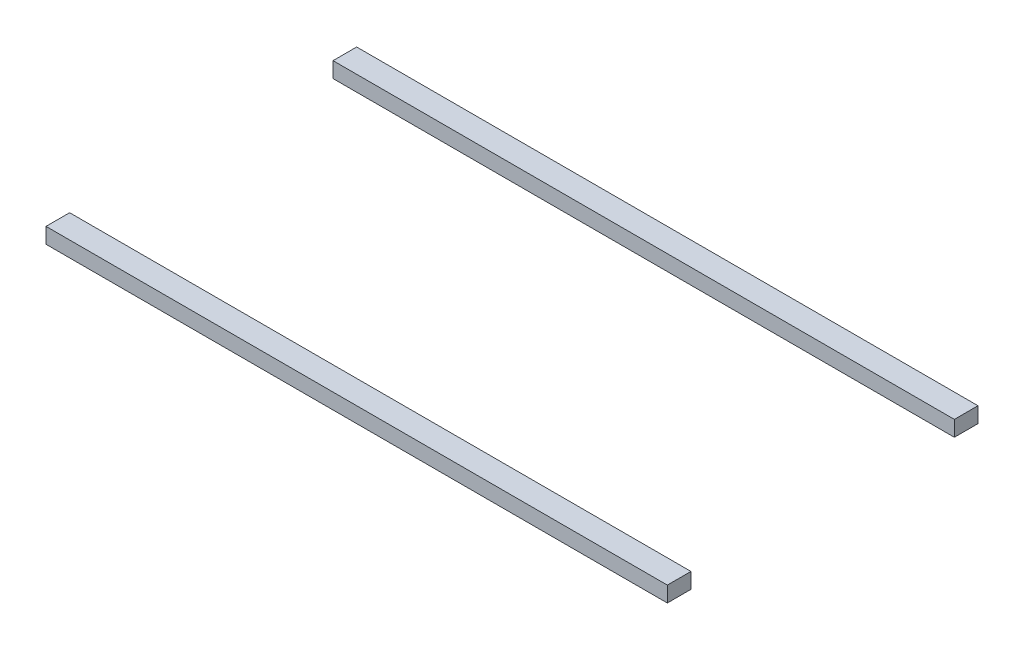
ISO-10303-21;
HEADER;
FILE_DESCRIPTION(('STEP AP214'),'2;1');
FILE_NAME('part.step','',(''),(''),'','','');
FILE_SCHEMA(('AUTOMOTIVE_DESIGN { 1 0 10303 214 1 1 1 1 }'));
ENDSEC;
DATA;
#1=APPLICATION_CONTEXT('core data for automotive mechanical design processes');
#2=APPLICATION_PROTOCOL_DEFINITION('international standard','automotive_design',2000,#1);
#3=PRODUCT_CONTEXT('',#1,'mechanical');
#4=PRODUCT('Part','Part','',(#3));
#5=PRODUCT_RELATED_PRODUCT_CATEGORY('part','',(#4));
#6=PRODUCT_DEFINITION_FORMATION('','',#4);
#7=PRODUCT_DEFINITION_CONTEXT('part definition',#1,'design');
#8=PRODUCT_DEFINITION('design','',#6,#7);
#9=PRODUCT_DEFINITION_SHAPE('','',#8);
#10=(LENGTH_UNIT() NAMED_UNIT(*) SI_UNIT(.MILLI.,.METRE.));
#11=(NAMED_UNIT(*) PLANE_ANGLE_UNIT() SI_UNIT($,.RADIAN.));
#12=(NAMED_UNIT(*) SI_UNIT($,.STERADIAN.) SOLID_ANGLE_UNIT());
#13=UNCERTAINTY_MEASURE_WITH_UNIT(LENGTH_MEASURE(1.E-05),#10,'distance_accuracy_value','');
#14=(GEOMETRIC_REPRESENTATION_CONTEXT(3) GLOBAL_UNCERTAINTY_ASSIGNED_CONTEXT((#13)) GLOBAL_UNIT_ASSIGNED_CONTEXT((#10,
#11,#12)) REPRESENTATION_CONTEXT('',''));
#15=CARTESIAN_POINT('',(0.,0.,0.));
#16=DIRECTION('',(0.,0.,1.));
#17=DIRECTION('',(1.,0.,0.));
#18=AXIS2_PLACEMENT_3D('',#15,#16,#17);
#19=CARTESIAN_POINT('',(0.,2.54,-21.5339538869623));
#20=DIRECTION('',(0.,0.,1.));
#21=DIRECTION('',(1.,0.,0.));
#22=AXIS2_PLACEMENT_3D('',#19,#20,#21);
#23=PLANE('',#22);
#24=DIRECTION('',(-1.,0.,0.));
#25=VECTOR('',#24,1.);
#26=CARTESIAN_POINT('',(0.,0.,-21.5339538869623));
#27=LINE('',#26,#25);
#28=CARTESIAN_POINT('',(50.8000000000001,0.,-21.5339538869623));
#29=VERTEX_POINT('',#28);
#30=CARTESIAN_POINT('',(-50.8000000000001,0.,-21.5339538869623));
#31=VERTEX_POINT('',#30);
#32=EDGE_CURVE('E108',#29,#31,#27,.T.);
#33=ORIENTED_EDGE('',*,*,#32,.F.);
#34=DIRECTION('',(0.,-1.,0.));
#35=VECTOR('',#34,1.);
#36=CARTESIAN_POINT('',(50.8000000000001,2.54,-21.5339538869623));
#37=LINE('',#36,#35);
#38=CARTESIAN_POINT('',(50.8000000000001,2.54,-21.5339538869623));
#39=VERTEX_POINT('',#38);
#40=EDGE_CURVE('E12',#39,#29,#37,.T.);
#41=ORIENTED_EDGE('',*,*,#40,.F.);
#42=DIRECTION('',(-1.,0.,0.));
#43=VECTOR('',#42,1.);
#44=CARTESIAN_POINT('',(0.,2.54,-21.5339538869623));
#45=LINE('',#44,#43);
#46=CARTESIAN_POINT('',(-50.8000000000001,2.54,-21.5339538869623));
#47=VERTEX_POINT('',#46);
#48=EDGE_CURVE('E101',#39,#47,#45,.T.);
#49=ORIENTED_EDGE('',*,*,#48,.T.);
#50=DIRECTION('',(0.,-1.,0.));
#51=VECTOR('',#50,1.);
#52=CARTESIAN_POINT('',(-50.8000000000001,2.54,-21.5339538869623));
#53=LINE('',#52,#51);
#54=EDGE_CURVE('E83',#47,#31,#53,.T.);
#55=ORIENTED_EDGE('',*,*,#54,.T.);
#56=EDGE_LOOP('',(#33,#41,#49,#55));
#57=FACE_BOUND('',#56,.T.);
#58=ADVANCED_FACE('F45',(#57),#23,.T.);
#59=CARTESIAN_POINT('',(50.8000000000001,2.54,0.));
#60=DIRECTION('',(1.,0.,0.));
#61=DIRECTION('',(0.,0.,-1.));
#62=AXIS2_PLACEMENT_3D('',#59,#60,#61);
#63=PLANE('',#62);
#64=DIRECTION('',(0.,0.,1.));
#65=VECTOR('',#64,1.);
#66=CARTESIAN_POINT('',(50.8000000000001,0.,0.));
#67=LINE('',#66,#65);
#68=CARTESIAN_POINT('',(50.8000000000001,0.,-25.4));
#69=VERTEX_POINT('',#68);
#70=EDGE_CURVE('E94',#69,#29,#67,.T.);
#71=ORIENTED_EDGE('',*,*,#70,.F.);
#72=DIRECTION('',(0.,-1.,0.));
#73=VECTOR('',#72,1.);
#74=CARTESIAN_POINT('',(50.8000000000001,2.54,-25.4));
#75=LINE('',#74,#73);
#76=CARTESIAN_POINT('',(50.8000000000001,2.54,-25.4));
#77=VERTEX_POINT('',#76);
#78=EDGE_CURVE('E53',#77,#69,#75,.T.);
#79=ORIENTED_EDGE('',*,*,#78,.F.);
#80=DIRECTION('',(0.,0.,1.));
#81=VECTOR('',#80,1.);
#82=CARTESIAN_POINT('',(50.8000000000001,2.54,0.));
#83=LINE('',#82,#81);
#84=EDGE_CURVE('E92',#77,#39,#83,.T.);
#85=ORIENTED_EDGE('',*,*,#84,.T.);
#86=ORIENTED_EDGE('',*,*,#40,.T.);
#87=EDGE_LOOP('',(#71,#79,#85,#86));
#88=FACE_BOUND('',#87,.T.);
#89=ADVANCED_FACE('F91',(#88),#63,.T.);
#90=CARTESIAN_POINT('',(0.,2.54,-25.4));
#91=DIRECTION('',(0.,0.,-1.));
#92=DIRECTION('',(-1.,0.,0.));
#93=AXIS2_PLACEMENT_3D('',#90,#91,#92);
#94=PLANE('',#93);
#95=DIRECTION('',(1.,0.,0.));
#96=VECTOR('',#95,1.);
#97=CARTESIAN_POINT('',(0.,0.,-25.4));
#98=LINE('',#97,#96);
#99=CARTESIAN_POINT('',(-50.8000000000001,0.,-25.4));
#100=VERTEX_POINT('',#99);
#101=EDGE_CURVE('E112',#100,#69,#98,.T.);
#102=ORIENTED_EDGE('',*,*,#101,.F.);
#103=DIRECTION('',(0.,-1.,0.));
#104=VECTOR('',#103,1.);
#105=CARTESIAN_POINT('',(-50.8000000000001,2.54,-25.4));
#106=LINE('',#105,#104);
#107=CARTESIAN_POINT('',(-50.8000000000001,2.54,-25.4));
#108=VERTEX_POINT('',#107);
#109=EDGE_CURVE('E76',#108,#100,#106,.T.);
#110=ORIENTED_EDGE('',*,*,#109,.F.);
#111=DIRECTION('',(1.,0.,0.));
#112=VECTOR('',#111,1.);
#113=CARTESIAN_POINT('',(0.,2.54,-25.4));
#114=LINE('',#113,#112);
#115=EDGE_CURVE('E100',#108,#77,#114,.T.);
#116=ORIENTED_EDGE('',*,*,#115,.T.);
#117=ORIENTED_EDGE('',*,*,#78,.T.);
#118=EDGE_LOOP('',(#102,#110,#116,#117));
#119=FACE_BOUND('',#118,.T.);
#120=ADVANCED_FACE('F103',(#119),#94,.T.);
#121=CARTESIAN_POINT('',(-50.8000000000001,2.54,0.));
#122=DIRECTION('',(1.,0.,0.));
#123=DIRECTION('',(0.,0.,-1.));
#124=AXIS2_PLACEMENT_3D('',#121,#122,#123);
#125=PLANE('',#124);
#126=DIRECTION('',(0.,0.,1.));
#127=VECTOR('',#126,1.);
#128=CARTESIAN_POINT('',(-50.8000000000001,0.,0.));
#129=LINE('',#128,#127);
#130=EDGE_CURVE('E114',#100,#31,#129,.T.);
#131=ORIENTED_EDGE('',*,*,#130,.T.);
#132=ORIENTED_EDGE('',*,*,#54,.F.);
#133=DIRECTION('',(0.,0.,1.));
#134=VECTOR('',#133,1.);
#135=CARTESIAN_POINT('',(-50.8000000000001,2.54,0.));
#136=LINE('',#135,#134);
#137=EDGE_CURVE('E61',#108,#47,#136,.T.);
#138=ORIENTED_EDGE('',*,*,#137,.F.);
#139=ORIENTED_EDGE('',*,*,#109,.T.);
#140=EDGE_LOOP('',(#131,#132,#138,#139));
#141=FACE_BOUND('',#140,.T.);
#142=ADVANCED_FACE('F124',(#141),#125,.F.);
#143=CARTESIAN_POINT('',(0.,2.54,0.));
#144=DIRECTION('',(0.,1.,0.));
#145=DIRECTION('',(0.,0.,1.));
#146=AXIS2_PLACEMENT_3D('',#143,#144,#145);
#147=PLANE('',#146);
#148=ORIENTED_EDGE('',*,*,#48,.F.);
#149=ORIENTED_EDGE('',*,*,#84,.F.);
#150=ORIENTED_EDGE('',*,*,#115,.F.);
#151=ORIENTED_EDGE('',*,*,#137,.T.);
#152=EDGE_LOOP('',(#148,#149,#150,#151));
#153=FACE_BOUND('',#152,.T.);
#154=ADVANCED_FACE('F99',(#153),#147,.T.);
#155=CARTESIAN_POINT('',(0.,0.,0.));
#156=DIRECTION('',(0.,1.,0.));
#157=DIRECTION('',(0.,0.,1.));
#158=AXIS2_PLACEMENT_3D('',#155,#156,#157);
#159=PLANE('',#158);
#160=ORIENTED_EDGE('',*,*,#32,.T.);
#161=ORIENTED_EDGE('',*,*,#130,.F.);
#162=ORIENTED_EDGE('',*,*,#101,.T.);
#163=ORIENTED_EDGE('',*,*,#70,.T.);
#164=EDGE_LOOP('',(#160,#161,#162,#163));
#165=FACE_BOUND('',#164,.T.);
#166=ADVANCED_FACE('F129',(#165),#159,.F.);
#167=CLOSED_SHELL('',(#58,#89,#120,#142,#154,#166));
#168=MANIFOLD_SOLID_BREP('B2',#167);
#169=CARTESIAN_POINT('',(50.8000000000001,2.54,0.));
#170=DIRECTION('',(1.,0.,0.));
#171=DIRECTION('',(0.,0.,-1.));
#172=AXIS2_PLACEMENT_3D('',#169,#170,#171);
#173=PLANE('',#172);
#174=DIRECTION('',(0.,0.,1.));
#175=VECTOR('',#174,1.);
#176=CARTESIAN_POINT('',(50.8000000000001,0.,0.));
#177=LINE('',#176,#175);
#178=CARTESIAN_POINT('',(50.8000000000001,0.,21.5339538869622));
#179=VERTEX_POINT('',#178);
#180=CARTESIAN_POINT('',(50.8000000000001,0.,25.4));
#181=VERTEX_POINT('',#180);
#182=EDGE_CURVE('E231',#179,#181,#177,.T.);
#183=ORIENTED_EDGE('',*,*,#182,.F.);
#184=DIRECTION('',(0.,-1.,0.));
#185=VECTOR('',#184,1.);
#186=CARTESIAN_POINT('',(50.8000000000001,2.54,21.5339538869622));
#187=LINE('',#186,#185);
#188=CARTESIAN_POINT('',(50.8000000000001,2.54,21.5339538869622));
#189=VERTEX_POINT('',#188);
#190=EDGE_CURVE('E43',#189,#179,#187,.T.);
#191=ORIENTED_EDGE('',*,*,#190,.F.);
#192=DIRECTION('',(0.,0.,1.));
#193=VECTOR('',#192,1.);
#194=CARTESIAN_POINT('',(50.8000000000001,2.54,0.));
#195=LINE('',#194,#193);
#196=CARTESIAN_POINT('',(50.8000000000001,2.54,25.4));
#197=VERTEX_POINT('',#196);
#198=EDGE_CURVE('E219',#189,#197,#195,.T.);
#199=ORIENTED_EDGE('',*,*,#198,.T.);
#200=DIRECTION('',(0.,-1.,0.));
#201=VECTOR('',#200,1.);
#202=CARTESIAN_POINT('',(50.8000000000001,2.54,25.4));
#203=LINE('',#202,#201);
#204=EDGE_CURVE('E208',#197,#181,#203,.T.);
#205=ORIENTED_EDGE('',*,*,#204,.T.);
#206=EDGE_LOOP('',(#183,#191,#199,#205));
#207=FACE_BOUND('',#206,.T.);
#208=ADVANCED_FACE('F169',(#207),#173,.T.);
#209=CARTESIAN_POINT('',(0.,2.54,21.5339538869622));
#210=DIRECTION('',(0.,0.,1.));
#211=DIRECTION('',(1.,0.,0.));
#212=AXIS2_PLACEMENT_3D('',#209,#210,#211);
#213=PLANE('',#212);
#214=DIRECTION('',(-1.,0.,0.));
#215=VECTOR('',#214,1.);
#216=CARTESIAN_POINT('',(0.,0.,21.5339538869622));
#217=LINE('',#216,#215);
#218=CARTESIAN_POINT('',(-50.8000000000001,0.,21.5339538869622));
#219=VERTEX_POINT('',#218);
#220=EDGE_CURVE('E224',#179,#219,#217,.T.);
#221=ORIENTED_EDGE('',*,*,#220,.T.);
#222=DIRECTION('',(0.,-1.,0.));
#223=VECTOR('',#222,1.);
#224=CARTESIAN_POINT('',(-50.8000000000001,2.54,21.5339538869622));
#225=LINE('',#224,#223);
#226=CARTESIAN_POINT('',(-50.8000000000001,2.54,21.5339538869622));
#227=VERTEX_POINT('',#226);
#228=EDGE_CURVE('E177',#227,#219,#225,.T.);
#229=ORIENTED_EDGE('',*,*,#228,.F.);
#230=DIRECTION('',(-1.,0.,0.));
#231=VECTOR('',#230,1.);
#232=CARTESIAN_POINT('',(0.,2.54,21.5339538869622));
#233=LINE('',#232,#231);
#234=EDGE_CURVE('E214',#189,#227,#233,.T.);
#235=ORIENTED_EDGE('',*,*,#234,.F.);
#236=ORIENTED_EDGE('',*,*,#190,.T.);
#237=EDGE_LOOP('',(#221,#229,#235,#236));
#238=FACE_BOUND('',#237,.T.);
#239=ADVANCED_FACE('F222',(#238),#213,.F.);
#240=CARTESIAN_POINT('',(-50.8000000000001,2.54,0.));
#241=DIRECTION('',(1.,0.,0.));
#242=DIRECTION('',(0.,0.,-1.));
#243=AXIS2_PLACEMENT_3D('',#240,#241,#242);
#244=PLANE('',#243);
#245=DIRECTION('',(0.,0.,1.));
#246=VECTOR('',#245,1.);
#247=CARTESIAN_POINT('',(-50.8000000000001,0.,0.));
#248=LINE('',#247,#246);
#249=CARTESIAN_POINT('',(-50.8000000000001,0.,25.4));
#250=VERTEX_POINT('',#249);
#251=EDGE_CURVE('E201',#219,#250,#248,.T.);
#252=ORIENTED_EDGE('',*,*,#251,.T.);
#253=DIRECTION('',(0.,-1.,0.));
#254=VECTOR('',#253,1.);
#255=CARTESIAN_POINT('',(-50.8000000000001,2.54,25.4));
#256=LINE('',#255,#254);
#257=CARTESIAN_POINT('',(-50.8000000000001,2.54,25.4));
#258=VERTEX_POINT('',#257);
#259=EDGE_CURVE('E225',#258,#250,#256,.T.);
#260=ORIENTED_EDGE('',*,*,#259,.F.);
#261=DIRECTION('',(0.,0.,1.));
#262=VECTOR('',#261,1.);
#263=CARTESIAN_POINT('',(-50.8000000000001,2.54,0.));
#264=LINE('',#263,#262);
#265=EDGE_CURVE('E218',#227,#258,#264,.T.);
#266=ORIENTED_EDGE('',*,*,#265,.F.);
#267=ORIENTED_EDGE('',*,*,#228,.T.);
#268=EDGE_LOOP('',(#252,#260,#266,#267));
#269=FACE_BOUND('',#268,.T.);
#270=ADVANCED_FACE('F226',(#269),#244,.F.);
#271=CARTESIAN_POINT('',(0.,2.54,25.4));
#272=DIRECTION('',(0.,0.,-1.));
#273=DIRECTION('',(-1.,0.,0.));
#274=AXIS2_PLACEMENT_3D('',#271,#272,#273);
#275=PLANE('',#274);
#276=DIRECTION('',(1.,0.,0.));
#277=VECTOR('',#276,1.);
#278=CARTESIAN_POINT('',(0.,0.,25.4));
#279=LINE('',#278,#277);
#280=EDGE_CURVE('E236',#250,#181,#279,.T.);
#281=ORIENTED_EDGE('',*,*,#280,.T.);
#282=ORIENTED_EDGE('',*,*,#204,.F.);
#283=DIRECTION('',(1.,0.,0.));
#284=VECTOR('',#283,1.);
#285=CARTESIAN_POINT('',(0.,2.54,25.4));
#286=LINE('',#285,#284);
#287=EDGE_CURVE('E185',#258,#197,#286,.T.);
#288=ORIENTED_EDGE('',*,*,#287,.F.);
#289=ORIENTED_EDGE('',*,*,#259,.T.);
#290=EDGE_LOOP('',(#281,#282,#288,#289));
#291=FACE_BOUND('',#290,.T.);
#292=ADVANCED_FACE('F241',(#291),#275,.F.);
#293=CARTESIAN_POINT('',(0.,2.54,0.));
#294=DIRECTION('',(0.,1.,0.));
#295=DIRECTION('',(0.,0.,1.));
#296=AXIS2_PLACEMENT_3D('',#293,#294,#295);
#297=PLANE('',#296);
#298=ORIENTED_EDGE('',*,*,#198,.F.);
#299=ORIENTED_EDGE('',*,*,#234,.T.);
#300=ORIENTED_EDGE('',*,*,#265,.T.);
#301=ORIENTED_EDGE('',*,*,#287,.T.);
#302=EDGE_LOOP('',(#298,#299,#300,#301));
#303=FACE_BOUND('',#302,.T.);
#304=ADVANCED_FACE('F216',(#303),#297,.T.);
#305=CARTESIAN_POINT('',(0.,0.,0.));
#306=DIRECTION('',(0.,1.,0.));
#307=DIRECTION('',(0.,0.,1.));
#308=AXIS2_PLACEMENT_3D('',#305,#306,#307);
#309=PLANE('',#308);
#310=ORIENTED_EDGE('',*,*,#182,.T.);
#311=ORIENTED_EDGE('',*,*,#280,.F.);
#312=ORIENTED_EDGE('',*,*,#251,.F.);
#313=ORIENTED_EDGE('',*,*,#220,.F.);
#314=EDGE_LOOP('',(#310,#311,#312,#313));
#315=FACE_BOUND('',#314,.T.);
#316=ADVANCED_FACE('F243',(#315),#309,.F.);
#317=CLOSED_SHELL('',(#208,#239,#270,#292,#304,#316));
#318=MANIFOLD_SOLID_BREP('B6',#317);
#319=ADVANCED_BREP_SHAPE_REPRESENTATION('',(#18,#168,#318),#14);
#320=SHAPE_DEFINITION_REPRESENTATION(#9,#319);
ENDSEC;
END-ISO-10303-21;
